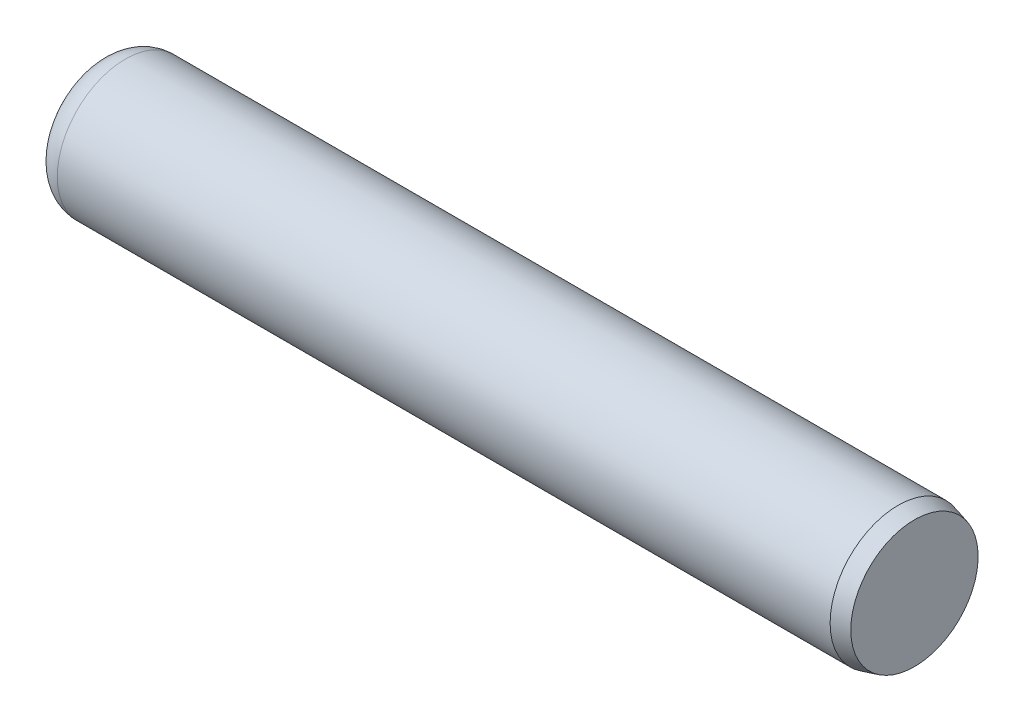
ISO-10303-21;
HEADER;
FILE_DESCRIPTION(('STEP AP214'),'2;1');
FILE_NAME('part.step','',(''),(''),'','','');
FILE_SCHEMA(('AUTOMOTIVE_DESIGN { 1 0 10303 214 1 1 1 1 }'));
ENDSEC;
DATA;
#1=APPLICATION_CONTEXT('core data for automotive mechanical design processes');
#2=APPLICATION_PROTOCOL_DEFINITION('international standard','automotive_design',2000,#1);
#3=PRODUCT_CONTEXT('',#1,'mechanical');
#4=PRODUCT('Part','Part','',(#3));
#5=PRODUCT_RELATED_PRODUCT_CATEGORY('part','',(#4));
#6=PRODUCT_DEFINITION_FORMATION('','',#4);
#7=PRODUCT_DEFINITION_CONTEXT('part definition',#1,'design');
#8=PRODUCT_DEFINITION('design','',#6,#7);
#9=PRODUCT_DEFINITION_SHAPE('','',#8);
#10=(LENGTH_UNIT() NAMED_UNIT(*) SI_UNIT(.MILLI.,.METRE.));
#11=(NAMED_UNIT(*) PLANE_ANGLE_UNIT() SI_UNIT($,.RADIAN.));
#12=(NAMED_UNIT(*) SI_UNIT($,.STERADIAN.) SOLID_ANGLE_UNIT());
#13=UNCERTAINTY_MEASURE_WITH_UNIT(LENGTH_MEASURE(1.E-05),#10,'distance_accuracy_value','');
#14=(GEOMETRIC_REPRESENTATION_CONTEXT(3) GLOBAL_UNCERTAINTY_ASSIGNED_CONTEXT((#13)) GLOBAL_UNIT_ASSIGNED_CONTEXT((#10,
#11,#12)) REPRESENTATION_CONTEXT('',''));
#15=CARTESIAN_POINT('',(0.,0.,0.));
#16=DIRECTION('',(0.,0.,1.));
#17=DIRECTION('',(1.,0.,0.));
#18=AXIS2_PLACEMENT_3D('',#15,#16,#17);
#19=CARTESIAN_POINT('',(0.,0.238124999999992,0.));
#20=DIRECTION('',(1.,0.,0.));
#21=DIRECTION('',(0.,0.,-1.00000000000001));
#22=AXIS2_PLACEMENT_3D('',#19,#20,#21);
#23=PLANE('',#22);
#24=CARTESIAN_POINT('',(0.,0.,-1.16226472890446E-13));
#25=DIRECTION('',(-1.,0.,0.));
#26=DIRECTION('',(0.,0.,1.00000000000001));
#27=AXIS2_PLACEMENT_3D('',#24,#25,#26);
#28=CIRCLE('',#27,0.238124999999998);
#29=CARTESIAN_POINT('',(0.,0.,0.238124999999883));
#30=VERTEX_POINT('',#29);
#31=EDGE_CURVE('E44',#30,#30,#28,.T.);
#32=ORIENTED_EDGE('',*,*,#31,.T.);
#33=EDGE_LOOP('',(#32));
#34=FACE_BOUND('',#33,.T.);
#35=ADVANCED_FACE('F30',(#34),#23,.F.);
#36=CARTESIAN_POINT('',(4.76250000000002,0.,0.));
#37=DIRECTION('',(-1.,0.,0.));
#38=DIRECTION('',(0.,0.,1.00000000000001));
#39=AXIS2_PLACEMENT_3D('',#36,#37,#38);
#40=PLANE('',#39);
#41=CARTESIAN_POINT('',(4.76250000000002,0.,0.));
#42=DIRECTION('',(-1.,0.,0.));
#43=DIRECTION('',(0.,0.,1.00000000000001));
#44=AXIS2_PLACEMENT_3D('',#41,#42,#43);
#45=CIRCLE('',#44,0.371352839420935);
#46=CARTESIAN_POINT('',(4.76250000000002,0.,0.371352839420889));
#47=VERTEX_POINT('',#46);
#48=EDGE_CURVE('E10',#47,#47,#45,.T.);
#49=ORIENTED_EDGE('',*,*,#48,.F.);
#50=EDGE_LOOP('',(#49));
#51=FACE_BOUND('',#50,.T.);
#52=ADVANCED_FACE('F64',(#51),#40,.F.);
#53=CARTESIAN_POINT('',(4.76250000000002,0.,0.));
#54=DIRECTION('',(-1.,0.,0.));
#55=DIRECTION('',(0.,0.,1.00000000000001));
#56=AXIS2_PLACEMENT_3D('',#53,#54,#55);
#57=CONICAL_SURFACE('',#56,0.371352839420935,0.261799387799145);
#58=CARTESIAN_POINT('',(4.66725,0.,0.));
#59=DIRECTION('',(-1.,0.,0.));
#60=DIRECTION('',(0.,0.,1.00000000000001));
#61=AXIS2_PLACEMENT_3D('',#58,#59,#60);
#62=CIRCLE('',#61,0.396875);
#63=CARTESIAN_POINT('',(4.66725,0.,0.396874999999954));
#64=VERTEX_POINT('',#63);
#65=EDGE_CURVE('E36',#64,#64,#62,.T.);
#66=ORIENTED_EDGE('',*,*,#65,.F.);
#67=EDGE_LOOP('',(#66));
#68=FACE_BOUND('',#67,.T.);
#69=ORIENTED_EDGE('',*,*,#48,.T.);
#70=EDGE_LOOP('',(#69));
#71=FACE_BOUND('',#70,.T.);
#72=ADVANCED_FACE('F59',(#68,#71),#57,.T.);
#73=CARTESIAN_POINT('',(-6.34999999999998,0.,-1.17961196366423E-13));
#74=DIRECTION('',(-1.,0.,0.));
#75=DIRECTION('',(0.,0.,1.00000000000001));
#76=AXIS2_PLACEMENT_3D('',#73,#74,#75);
#77=CYLINDRICAL_SURFACE('',#76,0.396874999999999);
#78=CARTESIAN_POINT('',(0.158749999999999,0.,-1.16226472890446E-13));
#79=DIRECTION('',(-1.,0.,0.));
#80=DIRECTION('',(0.,0.,1.00000000000001));
#81=AXIS2_PLACEMENT_3D('',#78,#79,#80);
#82=CIRCLE('',#81,0.396874999999998);
#83=CARTESIAN_POINT('',(0.158749999999999,0.,0.396874999999884));
#84=VERTEX_POINT('',#83);
#85=EDGE_CURVE('E40',#84,#84,#82,.T.);
#86=ORIENTED_EDGE('',*,*,#85,.F.);
#87=EDGE_LOOP('',(#86));
#88=FACE_BOUND('',#87,.T.);
#89=ORIENTED_EDGE('',*,*,#65,.T.);
#90=EDGE_LOOP('',(#89));
#91=FACE_BOUND('',#90,.T.);
#92=ADVANCED_FACE('F54',(#88,#91),#77,.T.);
#93=CARTESIAN_POINT('',(0.158749999999999,0.,-1.16226472890446E-13));
#94=DIRECTION('',(-1.,0.,0.));
#95=DIRECTION('',(0.,0.,1.00000000000001));
#96=AXIS2_PLACEMENT_3D('',#93,#94,#95);
#97=TOROIDAL_SURFACE('',#96,0.238124999999998,0.15875);
#98=ORIENTED_EDGE('',*,*,#31,.F.);
#99=EDGE_LOOP('',(#98));
#100=FACE_BOUND('',#99,.T.);
#101=ORIENTED_EDGE('',*,*,#85,.T.);
#102=EDGE_LOOP('',(#101));
#103=FACE_BOUND('',#102,.T.);
#104=ADVANCED_FACE('F51',(#100,#103),#97,.T.);
#105=CLOSED_SHELL('',(#35,#52,#72,#92,#104));
#106=MANIFOLD_SOLID_BREP('B2',#105);
#107=ADVANCED_BREP_SHAPE_REPRESENTATION('',(#18,#106),#14);
#108=SHAPE_DEFINITION_REPRESENTATION(#9,#107);
ENDSEC;
END-ISO-10303-21;
